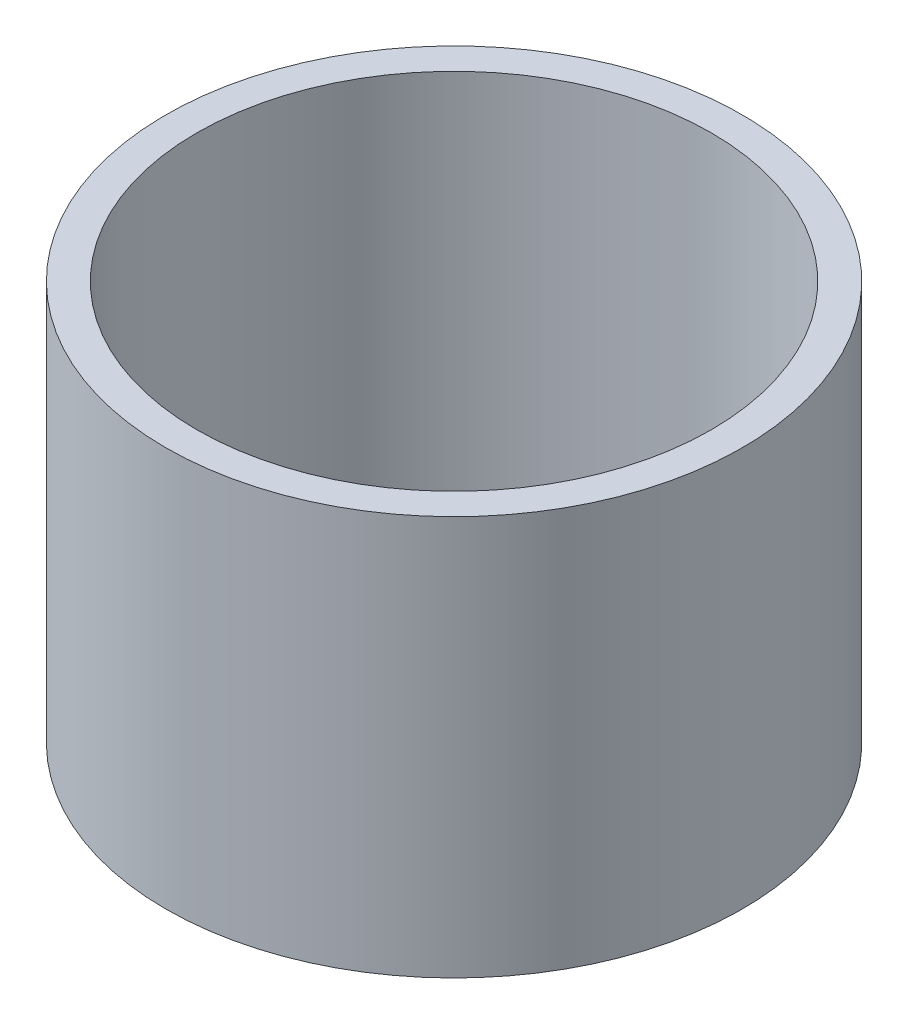
ISO-10303-21;
HEADER;
FILE_DESCRIPTION(('STEP AP214'),'2;1');
FILE_NAME('part.step','',(''),(''),'','','');
FILE_SCHEMA(('AUTOMOTIVE_DESIGN { 1 0 10303 214 1 1 1 1 }'));
ENDSEC;
DATA;
#1=APPLICATION_CONTEXT('core data for automotive mechanical design processes');
#2=APPLICATION_PROTOCOL_DEFINITION('international standard','automotive_design',2000,#1);
#3=PRODUCT_CONTEXT('',#1,'mechanical');
#4=PRODUCT('Part','Part','',(#3));
#5=PRODUCT_RELATED_PRODUCT_CATEGORY('part','',(#4));
#6=PRODUCT_DEFINITION_FORMATION('','',#4);
#7=PRODUCT_DEFINITION_CONTEXT('part definition',#1,'design');
#8=PRODUCT_DEFINITION('design','',#6,#7);
#9=PRODUCT_DEFINITION_SHAPE('','',#8);
#10=(LENGTH_UNIT() NAMED_UNIT(*) SI_UNIT(.MILLI.,.METRE.));
#11=(NAMED_UNIT(*) PLANE_ANGLE_UNIT() SI_UNIT($,.RADIAN.));
#12=(NAMED_UNIT(*) SI_UNIT($,.STERADIAN.) SOLID_ANGLE_UNIT());
#13=UNCERTAINTY_MEASURE_WITH_UNIT(LENGTH_MEASURE(1.E-05),#10,'distance_accuracy_value','');
#14=(GEOMETRIC_REPRESENTATION_CONTEXT(3) GLOBAL_UNCERTAINTY_ASSIGNED_CONTEXT((#13)) GLOBAL_UNIT_ASSIGNED_CONTEXT((#10,
#11,#12)) REPRESENTATION_CONTEXT('',''));
#15=CARTESIAN_POINT('',(0.,0.,0.));
#16=DIRECTION('',(0.,0.,1.));
#17=DIRECTION('',(1.,0.,0.));
#18=AXIS2_PLACEMENT_3D('',#15,#16,#17);
#19=CARTESIAN_POINT('',(0.,44.,0.));
#20=DIRECTION('',(0.,-1.,0.));
#21=DIRECTION('',(0.,0.,-1.));
#22=AXIS2_PLACEMENT_3D('',#19,#20,#21);
#23=CYLINDRICAL_SURFACE('',#22,31.75);
#24=CARTESIAN_POINT('',(0.,44.,0.));
#25=DIRECTION('',(0.,1.,0.));
#26=DIRECTION('',(0.,0.,1.));
#27=AXIS2_PLACEMENT_3D('',#24,#25,#26);
#28=CIRCLE('',#27,31.75);
#29=CARTESIAN_POINT('',(0.,44.,31.75));
#30=VERTEX_POINT('',#29);
#31=EDGE_CURVE('E10',#30,#30,#28,.T.);
#32=ORIENTED_EDGE('',*,*,#31,.F.);
#33=EDGE_LOOP('',(#32));
#34=FACE_BOUND('',#33,.T.);
#35=CARTESIAN_POINT('',(0.,0.,0.));
#36=DIRECTION('',(0.,1.,0.));
#37=DIRECTION('',(0.,0.,1.));
#38=AXIS2_PLACEMENT_3D('',#35,#36,#37);
#39=CIRCLE('',#38,31.75);
#40=CARTESIAN_POINT('',(0.,0.,31.75));
#41=VERTEX_POINT('',#40);
#42=EDGE_CURVE('E43',#41,#41,#39,.T.);
#43=ORIENTED_EDGE('',*,*,#42,.T.);
#44=EDGE_LOOP('',(#43));
#45=FACE_BOUND('',#44,.T.);
#46=ADVANCED_FACE('F40',(#34,#45),#23,.T.);
#47=CARTESIAN_POINT('',(0.,44.,0.));
#48=DIRECTION('',(0.,1.,0.));
#49=DIRECTION('',(0.,0.,1.));
#50=AXIS2_PLACEMENT_3D('',#47,#48,#49);
#51=PLANE('',#50);
#52=CARTESIAN_POINT('',(0.,44.,0.));
#53=DIRECTION('',(0.,1.,0.));
#54=DIRECTION('',(0.,0.,1.));
#55=AXIS2_PLACEMENT_3D('',#52,#53,#54);
#56=CIRCLE('',#55,28.328);
#57=CARTESIAN_POINT('',(0.,44.,28.328));
#58=VERTEX_POINT('',#57);
#59=EDGE_CURVE('E54',#58,#58,#56,.T.);
#60=ORIENTED_EDGE('',*,*,#59,.F.);
#61=EDGE_LOOP('',(#60));
#62=FACE_BOUND('',#61,.T.);
#63=ORIENTED_EDGE('',*,*,#31,.T.);
#64=EDGE_LOOP('',(#63));
#65=FACE_BOUND('',#64,.T.);
#66=ADVANCED_FACE('F60',(#62,#65),#51,.T.);
#67=CARTESIAN_POINT('',(0.,0.,0.));
#68=DIRECTION('',(0.,1.,0.));
#69=DIRECTION('',(0.,0.,1.));
#70=AXIS2_PLACEMENT_3D('',#67,#68,#69);
#71=PLANE('',#70);
#72=CARTESIAN_POINT('',(0.,0.,0.));
#73=DIRECTION('',(0.,1.,0.));
#74=DIRECTION('',(0.,0.,1.));
#75=AXIS2_PLACEMENT_3D('',#72,#73,#74);
#76=CIRCLE('',#75,28.328);
#77=CARTESIAN_POINT('',(0.,0.,28.328));
#78=VERTEX_POINT('',#77);
#79=EDGE_CURVE('E50',#78,#78,#76,.T.);
#80=ORIENTED_EDGE('',*,*,#79,.T.);
#81=EDGE_LOOP('',(#80));
#82=FACE_BOUND('',#81,.T.);
#83=ORIENTED_EDGE('',*,*,#42,.F.);
#84=EDGE_LOOP('',(#83));
#85=FACE_BOUND('',#84,.T.);
#86=ADVANCED_FACE('F62',(#82,#85),#71,.F.);
#87=CARTESIAN_POINT('',(0.,44.,0.));
#88=DIRECTION('',(0.,1.,0.));
#89=DIRECTION('',(0.,0.,1.));
#90=AXIS2_PLACEMENT_3D('',#87,#88,#89);
#91=CYLINDRICAL_SURFACE('',#90,28.328);
#92=ORIENTED_EDGE('',*,*,#79,.F.);
#93=EDGE_LOOP('',(#92));
#94=FACE_BOUND('',#93,.T.);
#95=ORIENTED_EDGE('',*,*,#59,.T.);
#96=EDGE_LOOP('',(#95));
#97=FACE_BOUND('',#96,.T.);
#98=ADVANCED_FACE('F58',(#94,#97),#91,.F.);
#99=CLOSED_SHELL('',(#46,#66,#86,#98));
#100=MANIFOLD_SOLID_BREP('B2',#99);
#101=ADVANCED_BREP_SHAPE_REPRESENTATION('',(#18,#100),#14);
#102=SHAPE_DEFINITION_REPRESENTATION(#9,#101);
ENDSEC;
END-ISO-10303-21;
